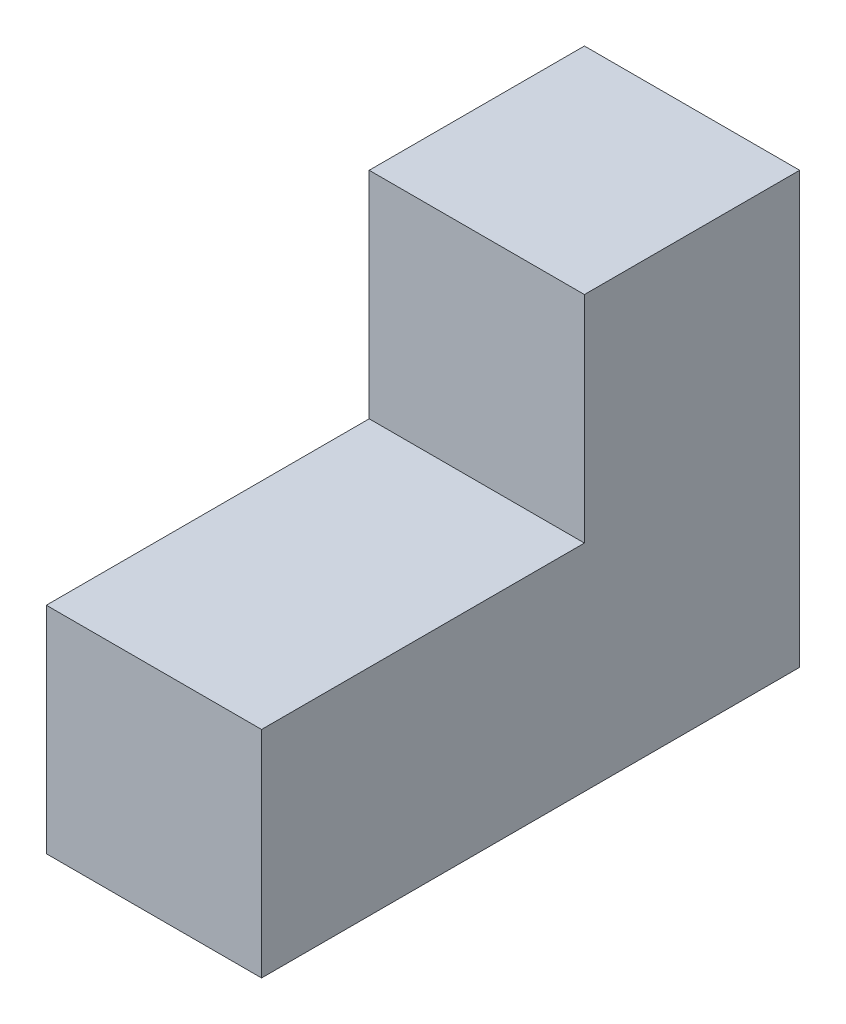
ISO-10303-21;
HEADER;
FILE_DESCRIPTION(('STEP AP214'),'2;1');
FILE_NAME('part.step','',(''),(''),'','','');
FILE_SCHEMA(('AUTOMOTIVE_DESIGN { 1 0 10303 214 1 1 1 1 }'));
ENDSEC;
DATA;
#1=APPLICATION_CONTEXT('core data for automotive mechanical design processes');
#2=APPLICATION_PROTOCOL_DEFINITION('international standard','automotive_design',2000,#1);
#3=PRODUCT_CONTEXT('',#1,'mechanical');
#4=PRODUCT('Part','Part','',(#3));
#5=PRODUCT_RELATED_PRODUCT_CATEGORY('part','',(#4));
#6=PRODUCT_DEFINITION_FORMATION('','',#4);
#7=PRODUCT_DEFINITION_CONTEXT('part definition',#1,'design');
#8=PRODUCT_DEFINITION('design','',#6,#7);
#9=PRODUCT_DEFINITION_SHAPE('','',#8);
#10=(LENGTH_UNIT() NAMED_UNIT(*) SI_UNIT(.MILLI.,.METRE.));
#11=(NAMED_UNIT(*) PLANE_ANGLE_UNIT() SI_UNIT($,.RADIAN.));
#12=(NAMED_UNIT(*) SI_UNIT($,.STERADIAN.) SOLID_ANGLE_UNIT());
#13=UNCERTAINTY_MEASURE_WITH_UNIT(LENGTH_MEASURE(1.E-05),#10,'distance_accuracy_value','');
#14=(GEOMETRIC_REPRESENTATION_CONTEXT(3) GLOBAL_UNCERTAINTY_ASSIGNED_CONTEXT((#13)) GLOBAL_UNIT_ASSIGNED_CONTEXT((#10,
#11,#12)) REPRESENTATION_CONTEXT('',''));
#15=CARTESIAN_POINT('',(0.,0.,0.));
#16=DIRECTION('',(0.,0.,1.));
#17=DIRECTION('',(1.,0.,0.));
#18=AXIS2_PLACEMENT_3D('',#15,#16,#17);
#19=CARTESIAN_POINT('',(20.,20.,0.));
#20=DIRECTION('',(0.,0.,-1.));
#21=DIRECTION('',(-1.,0.,0.));
#22=AXIS2_PLACEMENT_3D('',#19,#20,#21);
#23=PLANE('',#22);
#24=DIRECTION('',(0.,-1.,0.));
#25=VECTOR('',#24,1.);
#26=CARTESIAN_POINT('',(0.,20.,0.));
#27=LINE('',#26,#25);
#28=CARTESIAN_POINT('',(0.,20.,0.));
#29=VERTEX_POINT('',#28);
#30=CARTESIAN_POINT('',(0.,0.,0.));
#31=VERTEX_POINT('',#30);
#32=EDGE_CURVE('E119',#29,#31,#27,.T.);
#33=ORIENTED_EDGE('',*,*,#32,.T.);
#34=DIRECTION('',(-1.,0.,0.));
#35=VECTOR('',#34,1.);
#36=CARTESIAN_POINT('',(20.,0.,0.));
#37=LINE('',#36,#35);
#38=CARTESIAN_POINT('',(20.,0.,0.));
#39=VERTEX_POINT('',#38);
#40=EDGE_CURVE('E11',#39,#31,#37,.T.);
#41=ORIENTED_EDGE('',*,*,#40,.F.);
#42=DIRECTION('',(0.,-1.,0.));
#43=VECTOR('',#42,1.);
#44=CARTESIAN_POINT('',(20.,20.,0.));
#45=LINE('',#44,#43);
#46=CARTESIAN_POINT('',(20.,20.,0.));
#47=VERTEX_POINT('',#46);
#48=EDGE_CURVE('E129',#47,#39,#45,.T.);
#49=ORIENTED_EDGE('',*,*,#48,.F.);
#50=DIRECTION('',(-1.,0.,0.));
#51=VECTOR('',#50,1.);
#52=CARTESIAN_POINT('',(20.,20.,0.));
#53=LINE('',#52,#51);
#54=EDGE_CURVE('E115',#47,#29,#53,.T.);
#55=ORIENTED_EDGE('',*,*,#54,.T.);
#56=EDGE_LOOP('',(#33,#41,#49,#55));
#57=FACE_BOUND('',#56,.T.);
#58=ADVANCED_FACE('F35',(#57),#23,.F.);
#59=CARTESIAN_POINT('',(20.,0.,0.));
#60=DIRECTION('',(0.,1.,0.));
#61=DIRECTION('',(0.,0.,1.));
#62=AXIS2_PLACEMENT_3D('',#59,#60,#61);
#63=PLANE('',#62);
#64=DIRECTION('',(0.,0.,-1.));
#65=VECTOR('',#64,1.);
#66=CARTESIAN_POINT('',(0.,0.,0.));
#67=LINE('',#66,#65);
#68=CARTESIAN_POINT('',(0.,0.,-50.));
#69=VERTEX_POINT('',#68);
#70=EDGE_CURVE('E122',#31,#69,#67,.T.);
#71=ORIENTED_EDGE('',*,*,#70,.T.);
#72=DIRECTION('',(-1.,0.,0.));
#73=VECTOR('',#72,1.);
#74=CARTESIAN_POINT('',(20.,0.,-50.));
#75=LINE('',#74,#73);
#76=CARTESIAN_POINT('',(20.,0.,-50.));
#77=VERTEX_POINT('',#76);
#78=EDGE_CURVE('E43',#77,#69,#75,.T.);
#79=ORIENTED_EDGE('',*,*,#78,.F.);
#80=DIRECTION('',(0.,0.,-1.));
#81=VECTOR('',#80,1.);
#82=CARTESIAN_POINT('',(20.,0.,0.));
#83=LINE('',#82,#81);
#84=EDGE_CURVE('E88',#39,#77,#83,.T.);
#85=ORIENTED_EDGE('',*,*,#84,.F.);
#86=ORIENTED_EDGE('',*,*,#40,.T.);
#87=EDGE_LOOP('',(#71,#79,#85,#86));
#88=FACE_BOUND('',#87,.T.);
#89=ADVANCED_FACE('F153',(#88),#63,.F.);
#90=CARTESIAN_POINT('',(20.,0.,-50.));
#91=DIRECTION('',(0.,0.,1.));
#92=DIRECTION('',(1.,0.,0.));
#93=AXIS2_PLACEMENT_3D('',#90,#91,#92);
#94=PLANE('',#93);
#95=DIRECTION('',(0.,1.,0.));
#96=VECTOR('',#95,1.);
#97=CARTESIAN_POINT('',(0.,0.,-50.));
#98=LINE('',#97,#96);
#99=CARTESIAN_POINT('',(0.,40.,-50.));
#100=VERTEX_POINT('',#99);
#101=EDGE_CURVE('E124',#69,#100,#98,.T.);
#102=ORIENTED_EDGE('',*,*,#101,.T.);
#103=DIRECTION('',(-1.,0.,0.));
#104=VECTOR('',#103,1.);
#105=CARTESIAN_POINT('',(20.,40.,-50.));
#106=LINE('',#105,#104);
#107=CARTESIAN_POINT('',(20.,40.,-50.));
#108=VERTEX_POINT('',#107);
#109=EDGE_CURVE('E110',#108,#100,#106,.T.);
#110=ORIENTED_EDGE('',*,*,#109,.F.);
#111=DIRECTION('',(0.,1.,0.));
#112=VECTOR('',#111,1.);
#113=CARTESIAN_POINT('',(20.,0.,-50.));
#114=LINE('',#113,#112);
#115=EDGE_CURVE('E101',#77,#108,#114,.T.);
#116=ORIENTED_EDGE('',*,*,#115,.F.);
#117=ORIENTED_EDGE('',*,*,#78,.T.);
#118=EDGE_LOOP('',(#102,#110,#116,#117));
#119=FACE_BOUND('',#118,.T.);
#120=ADVANCED_FACE('F135',(#119),#94,.F.);
#121=CARTESIAN_POINT('',(20.,40.,-50.));
#122=DIRECTION('',(0.,-1.,0.));
#123=DIRECTION('',(0.,0.,-1.));
#124=AXIS2_PLACEMENT_3D('',#121,#122,#123);
#125=PLANE('',#124);
#126=DIRECTION('',(0.,0.,1.));
#127=VECTOR('',#126,1.);
#128=CARTESIAN_POINT('',(0.,40.,-50.));
#129=LINE('',#128,#127);
#130=CARTESIAN_POINT('',(0.,40.,-30.));
#131=VERTEX_POINT('',#130);
#132=EDGE_CURVE('E109',#100,#131,#129,.T.);
#133=ORIENTED_EDGE('',*,*,#132,.T.);
#134=DIRECTION('',(-1.,0.,0.));
#135=VECTOR('',#134,1.);
#136=CARTESIAN_POINT('',(20.,40.,-30.));
#137=LINE('',#136,#135);
#138=CARTESIAN_POINT('',(20.,40.,-30.));
#139=VERTEX_POINT('',#138);
#140=EDGE_CURVE('E106',#139,#131,#137,.T.);
#141=ORIENTED_EDGE('',*,*,#140,.F.);
#142=DIRECTION('',(0.,0.,1.));
#143=VECTOR('',#142,1.);
#144=CARTESIAN_POINT('',(20.,40.,-50.));
#145=LINE('',#144,#143);
#146=EDGE_CURVE('E95',#108,#139,#145,.T.);
#147=ORIENTED_EDGE('',*,*,#146,.F.);
#148=ORIENTED_EDGE('',*,*,#109,.T.);
#149=EDGE_LOOP('',(#133,#141,#147,#148));
#150=FACE_BOUND('',#149,.T.);
#151=ADVANCED_FACE('F107',(#150),#125,.F.);
#152=CARTESIAN_POINT('',(20.,40.,-30.));
#153=DIRECTION('',(0.,0.,-1.));
#154=DIRECTION('',(-1.,0.,0.));
#155=AXIS2_PLACEMENT_3D('',#152,#153,#154);
#156=PLANE('',#155);
#157=DIRECTION('',(0.,-1.,0.));
#158=VECTOR('',#157,1.);
#159=CARTESIAN_POINT('',(0.,40.,-30.));
#160=LINE('',#159,#158);
#161=CARTESIAN_POINT('',(0.,20.,-30.));
#162=VERTEX_POINT('',#161);
#163=EDGE_CURVE('E74',#131,#162,#160,.T.);
#164=ORIENTED_EDGE('',*,*,#163,.T.);
#165=DIRECTION('',(-1.,0.,0.));
#166=VECTOR('',#165,1.);
#167=CARTESIAN_POINT('',(20.,20.,-30.));
#168=LINE('',#167,#166);
#169=CARTESIAN_POINT('',(20.,20.,-30.));
#170=VERTEX_POINT('',#169);
#171=EDGE_CURVE('E111',#170,#162,#168,.T.);
#172=ORIENTED_EDGE('',*,*,#171,.F.);
#173=DIRECTION('',(0.,-1.,0.));
#174=VECTOR('',#173,1.);
#175=CARTESIAN_POINT('',(20.,40.,-30.));
#176=LINE('',#175,#174);
#177=EDGE_CURVE('E99',#139,#170,#176,.T.);
#178=ORIENTED_EDGE('',*,*,#177,.F.);
#179=ORIENTED_EDGE('',*,*,#140,.T.);
#180=EDGE_LOOP('',(#164,#172,#178,#179));
#181=FACE_BOUND('',#180,.T.);
#182=ADVANCED_FACE('F113',(#181),#156,.F.);
#183=CARTESIAN_POINT('',(20.,20.,-30.));
#184=DIRECTION('',(0.,-1.,0.));
#185=DIRECTION('',(0.,0.,-1.));
#186=AXIS2_PLACEMENT_3D('',#183,#184,#185);
#187=PLANE('',#186);
#188=DIRECTION('',(0.,0.,1.));
#189=VECTOR('',#188,1.);
#190=CARTESIAN_POINT('',(0.,20.,-30.));
#191=LINE('',#190,#189);
#192=EDGE_CURVE('E80',#162,#29,#191,.T.);
#193=ORIENTED_EDGE('',*,*,#192,.T.);
#194=ORIENTED_EDGE('',*,*,#54,.F.);
#195=DIRECTION('',(0.,0.,1.));
#196=VECTOR('',#195,1.);
#197=CARTESIAN_POINT('',(20.,20.,-30.));
#198=LINE('',#197,#196);
#199=EDGE_CURVE('E51',#170,#47,#198,.T.);
#200=ORIENTED_EDGE('',*,*,#199,.F.);
#201=ORIENTED_EDGE('',*,*,#171,.T.);
#202=EDGE_LOOP('',(#193,#194,#200,#201));
#203=FACE_BOUND('',#202,.T.);
#204=ADVANCED_FACE('F142',(#203),#187,.F.);
#205=CARTESIAN_POINT('',(20.,0.,0.));
#206=DIRECTION('',(1.,0.,0.));
#207=DIRECTION('',(0.,0.,-1.));
#208=AXIS2_PLACEMENT_3D('',#205,#206,#207);
#209=PLANE('',#208);
#210=ORIENTED_EDGE('',*,*,#48,.T.);
#211=ORIENTED_EDGE('',*,*,#84,.T.);
#212=ORIENTED_EDGE('',*,*,#115,.T.);
#213=ORIENTED_EDGE('',*,*,#146,.T.);
#214=ORIENTED_EDGE('',*,*,#177,.T.);
#215=ORIENTED_EDGE('',*,*,#199,.T.);
#216=EDGE_LOOP('',(#210,#211,#212,#213,#214,#215));
#217=FACE_BOUND('',#216,.T.);
#218=ADVANCED_FACE('F97',(#217),#209,.T.);
#219=CARTESIAN_POINT('',(0.,0.,0.));
#220=DIRECTION('',(1.,0.,0.));
#221=DIRECTION('',(0.,0.,-1.));
#222=AXIS2_PLACEMENT_3D('',#219,#220,#221);
#223=PLANE('',#222);
#224=ORIENTED_EDGE('',*,*,#32,.F.);
#225=ORIENTED_EDGE('',*,*,#192,.F.);
#226=ORIENTED_EDGE('',*,*,#163,.F.);
#227=ORIENTED_EDGE('',*,*,#132,.F.);
#228=ORIENTED_EDGE('',*,*,#101,.F.);
#229=ORIENTED_EDGE('',*,*,#70,.F.);
#230=EDGE_LOOP('',(#224,#225,#226,#227,#228,#229));
#231=FACE_BOUND('',#230,.T.);
#232=ADVANCED_FACE('F138',(#231),#223,.F.);
#233=CLOSED_SHELL('',(#58,#89,#120,#151,#182,#204,#218,#232));
#234=MANIFOLD_SOLID_BREP('B2',#233);
#235=ADVANCED_BREP_SHAPE_REPRESENTATION('',(#18,#234),#14);
#236=SHAPE_DEFINITION_REPRESENTATION(#9,#235);
ENDSEC;
END-ISO-10303-21;
